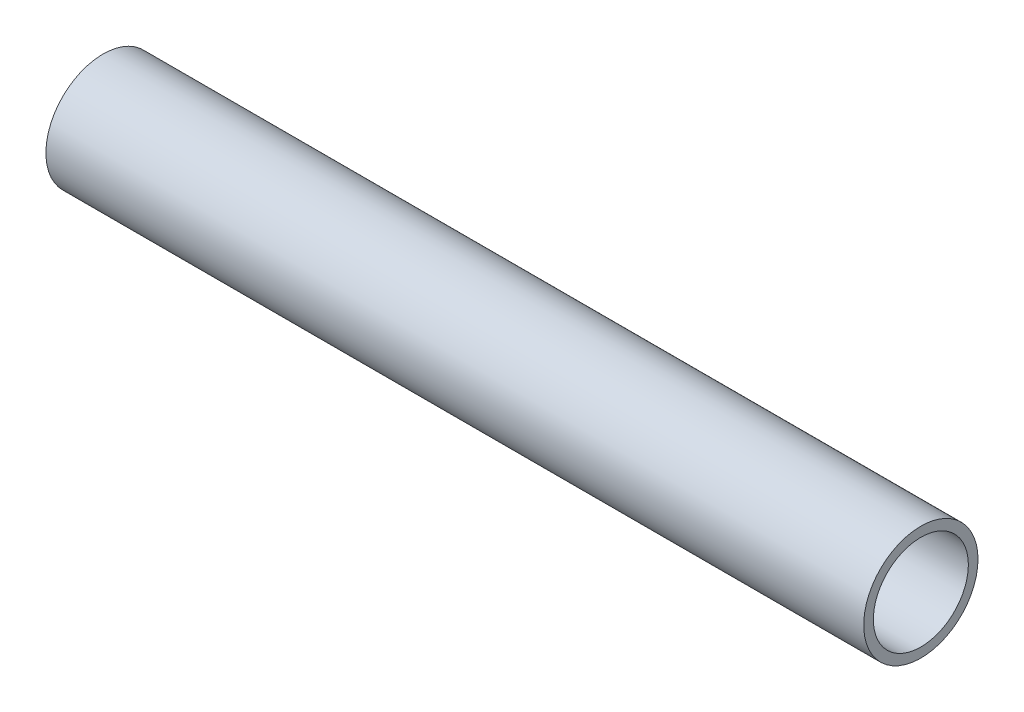
ISO-10303-21;
HEADER;
FILE_DESCRIPTION(('STEP AP214'),'2;1');
FILE_NAME('part.step','',(''),(''),'','','');
FILE_SCHEMA(('AUTOMOTIVE_DESIGN { 1 0 10303 214 1 1 1 1 }'));
ENDSEC;
DATA;
#1=APPLICATION_CONTEXT('core data for automotive mechanical design processes');
#2=APPLICATION_PROTOCOL_DEFINITION('international standard','automotive_design',2000,#1);
#3=PRODUCT_CONTEXT('',#1,'mechanical');
#4=PRODUCT('Part','Part','',(#3));
#5=PRODUCT_RELATED_PRODUCT_CATEGORY('part','',(#4));
#6=PRODUCT_DEFINITION_FORMATION('','',#4);
#7=PRODUCT_DEFINITION_CONTEXT('part definition',#1,'design');
#8=PRODUCT_DEFINITION('design','',#6,#7);
#9=PRODUCT_DEFINITION_SHAPE('','',#8);
#10=(LENGTH_UNIT() NAMED_UNIT(*) SI_UNIT(.MILLI.,.METRE.));
#11=(NAMED_UNIT(*) PLANE_ANGLE_UNIT() SI_UNIT($,.RADIAN.));
#12=(NAMED_UNIT(*) SI_UNIT($,.STERADIAN.) SOLID_ANGLE_UNIT());
#13=UNCERTAINTY_MEASURE_WITH_UNIT(LENGTH_MEASURE(1.E-05),#10,'distance_accuracy_value','');
#14=(GEOMETRIC_REPRESENTATION_CONTEXT(3) GLOBAL_UNCERTAINTY_ASSIGNED_CONTEXT((#13)) GLOBAL_UNIT_ASSIGNED_CONTEXT((#10,
#11,#12)) REPRESENTATION_CONTEXT('',''));
#15=CARTESIAN_POINT('',(0.,0.,0.));
#16=DIRECTION('',(0.,0.,1.));
#17=DIRECTION('',(1.,0.,0.));
#18=AXIS2_PLACEMENT_3D('',#15,#16,#17);
#19=CARTESIAN_POINT('',(-174.625,0.,0.));
#20=DIRECTION('',(1.,0.,0.));
#21=DIRECTION('',(0.,0.,-1.));
#22=AXIS2_PLACEMENT_3D('',#19,#20,#21);
#23=CYLINDRICAL_SURFACE('',#22,21.082);
#24=CARTESIAN_POINT('',(-95.25,0.,-21.082));
#25=CARTESIAN_POINT('',(-95.2500073037573,-0.177265588906064,-21.0819971511082));
#26=CARTESIAN_POINT('',(-95.2648956722781,-0.354633825443564,-21.0797407978607));
#27=CARTESIAN_POINT('',(-95.3240403602155,-0.704412011201185,-21.0709569196678));
#28=CARTESIAN_POINT('',(-95.3683252199961,-0.876816971803983,-21.064425243998));
#29=CARTESIAN_POINT('',(-95.4849091388346,-1.21155604974819,-21.0478246855302));
#30=CARTESIAN_POINT('',(-95.5571869641717,-1.37389769247853,-21.0377584843423));
#31=CARTESIAN_POINT('',(-95.7276530975323,-1.68412370373539,-21.0152009969064));
#32=CARTESIAN_POINT('',(-95.8258378289602,-1.83201006403648,-21.0027100454717));
#33=CARTESIAN_POINT('',(-96.0461542058056,-2.1103164343508,-20.9765819826565));
#34=CARTESIAN_POINT('',(-96.1684495601003,-2.24060616148058,-20.9629374218632));
#35=CARTESIAN_POINT('',(-96.4331633864275,-2.47889671955908,-20.9360982303561));
#36=CARTESIAN_POINT('',(-96.5755830188655,-2.58689626432783,-20.9229036256421));
#37=CARTESIAN_POINT('',(-96.8773786544134,-2.77804840978028,-20.8983859912104));
#38=CARTESIAN_POINT('',(-97.0368354067939,-2.86107486347092,-20.8870725883659));
#39=CARTESIAN_POINT('',(-97.3676295731584,-2.99911783525677,-20.8677000439257));
#40=CARTESIAN_POINT('',(-97.5389663337644,-3.05413589237424,-20.8596407235276));
#41=CARTESIAN_POINT('',(-97.8872863628436,-3.13419550245968,-20.8477621012251));
#42=CARTESIAN_POINT('',(-98.0642172558634,-3.15946016290709,-20.8439112577396));
#43=CARTESIAN_POINT('',(-98.419845943067,-3.17998699422211,-20.8407898425614));
#44=CARTESIAN_POINT('',(-98.5985436343971,-3.17525090142445,-20.8415190057945));
#45=CARTESIAN_POINT('',(-98.9510567099515,-3.13609297404926,-20.8474463775802));
#46=CARTESIAN_POINT('',(-99.1249004248299,-3.101919701057,-20.852607165254));
#47=CARTESIAN_POINT('',(-99.4643579756068,-3.00524659900985,-20.8667578327125));
#48=CARTESIAN_POINT('',(-99.6299715768266,-2.94274596272441,-20.8757478216156));
#49=CARTESIAN_POINT('',(-99.9490235812398,-2.7909340011809,-20.8965852461813));
#50=CARTESIAN_POINT('',(-100.102411162019,-2.70151746318004,-20.9084438587404));
#51=CARTESIAN_POINT('',(-100.392099144084,-2.498486828096,-20.9336742925736));
#52=CARTESIAN_POINT('',(-100.528398414064,-2.38487113028628,-20.9470462139227));
#53=CARTESIAN_POINT('',(-100.781481243325,-2.1353032656861,-20.9739618878806));
#54=CARTESIAN_POINT('',(-100.898054144489,-1.9991374095518,-20.9875060134767));
#55=CARTESIAN_POINT('',(-101.106725455512,-1.70906259522473,-21.0131148002247));
#56=CARTESIAN_POINT('',(-101.198823756631,-1.55515355820368,-21.0251794548033));
#57=CARTESIAN_POINT('',(-101.355942659601,-1.23377816277264,-21.0464826923882));
#58=CARTESIAN_POINT('',(-101.420946926471,-1.06630369822491,-21.0557195696406));
#59=CARTESIAN_POINT('',(-101.521848958346,-0.722645240857131,-21.070312259879));
#60=CARTESIAN_POINT('',(-101.557748707077,-0.546461842495156,-21.0756683373726));
#61=CARTESIAN_POINT('',(-101.599142333219,-0.192204765370484,-21.0818608911754));
#62=CARTESIAN_POINT('',(-101.604925808796,-0.0141656498471117,-21.0827404122035));
#63=CARTESIAN_POINT('',(-101.586691518388,0.340339952440575,-21.0799979514801));
#64=CARTESIAN_POINT('',(-101.562674682621,0.516806488119838,-21.0763761102388));
#65=CARTESIAN_POINT('',(-101.485762333879,0.862279899383912,-21.0650645063623));
#66=CARTESIAN_POINT('',(-101.433007989693,1.03131891039134,-21.0573946347692));
#67=CARTESIAN_POINT('',(-101.300267051749,1.35815274399449,-21.0388441665934));
#68=CARTESIAN_POINT('',(-101.220279170212,1.51594703443953,-21.0279634181826));
#69=CARTESIAN_POINT('',(-101.034662860785,1.8170851157619,-21.0040933283749));
#70=CARTESIAN_POINT('',(-100.928850826916,1.9603145348408,-20.9910891189132));
#71=CARTESIAN_POINT('',(-100.694845351182,2.22708618632573,-20.9644655933992));
#72=CARTESIAN_POINT('',(-100.566650597521,2.35062726403486,-20.9508462413297));
#73=CARTESIAN_POINT('',(-100.290229093112,2.57556977848285,-20.9243908347895));
#74=CARTESIAN_POINT('',(-100.141843493739,2.67677703259561,-20.9115622997957));
#75=CARTESIAN_POINT('',(-99.8300080053974,2.85282903090451,-20.888274456038));
#76=CARTESIAN_POINT('',(-99.6665585261644,2.92767449187153,-20.8778150828597));
#77=CARTESIAN_POINT('',(-99.3298127983176,3.04857772519442,-20.8605043047131));
#78=CARTESIAN_POINT('',(-99.156553855138,3.09473749350593,-20.8536401303661));
#79=CARTESIAN_POINT('',(-98.8046316089195,3.15728352894343,-20.8442630448294));
#80=CARTESIAN_POINT('',(-98.6259686832474,3.17367187018762,-20.8417498305174));
#81=CARTESIAN_POINT('',(-98.2702456638402,3.17616021106898,-20.8413705974415));
#82=CARTESIAN_POINT('',(-98.0931876803551,3.16256554437416,-20.8434577306442));
#83=CARTESIAN_POINT('',(-97.7439067922048,3.10612829026899,-20.8519421795031));
#84=CARTESIAN_POINT('',(-97.5716838795403,3.0632857512491,-20.8583394880282));
#85=CARTESIAN_POINT('',(-97.2370476835853,2.94967717748468,-20.874707044174));
#86=CARTESIAN_POINT('',(-97.0746269537971,2.87893265513937,-20.8846745386426));
#87=CARTESIAN_POINT('',(-96.7639105714977,2.71155871536682,-20.9070627102117));
#88=CARTESIAN_POINT('',(-96.6156154052644,2.61492840724794,-20.9194834717215));
#89=CARTESIAN_POINT('',(-96.3358087193127,2.39741725845485,-20.9455292166376));
#90=CARTESIAN_POINT('',(-96.2044739082908,2.27631033164997,-20.9591647100844));
#91=CARTESIAN_POINT('',(-95.9638828183518,2.01376149306829,-20.9860159394496));
#92=CARTESIAN_POINT('',(-95.8546316769312,1.87231486257537,-20.9992315770924));
#93=CARTESIAN_POINT('',(-95.6607669697578,1.57217776718591,-21.0238378848768));
#94=CARTESIAN_POINT('',(-95.5762935254673,1.41339594518084,-21.0352180180234));
#95=CARTESIAN_POINT('',(-95.4353412780308,1.08380087043067,-21.0547677779054));
#96=CARTESIAN_POINT('',(-95.3788335193363,0.913000272113382,-21.0629407235248));
#97=CARTESIAN_POINT('',(-95.3082168635909,0.61786433248082,-21.0732924950954));
#98=CARTESIAN_POINT('',(-95.2864189599853,0.495349503289427,-21.0765410154751));
#99=CARTESIAN_POINT('',(-95.2573080583054,0.248573261637359,-21.0808957533839));
#100=CARTESIAN_POINT('',(-95.2499948780599,0.124311871162614,-21.0820019978558));
#101=CARTESIAN_POINT('',(-95.25,0.,-21.082));
#102=B_SPLINE_CURVE_WITH_KNOTS('',3,(#24,#25,#26,#27,#28,#29,#30,#31,#32,#33,#34,#35,#36,#37,
#38,#39,#40,#41,#42,#43,#44,#45,#46,#47,#48,#49,#50,#51,#52,#53,#54,#55,#56,#57,#58,#59,#60,#61,
#62,#63,#64,#65,#66,#67,#68,#69,#70,#71,#72,#73,#74,#75,#76,#77,#78,#79,#80,#81,#82,#83,#84,#85,
#86,#87,#88,#89,#90,#91,#92,#93,#94,#95,#96,#97,#98,#99,#100,#101),.UNSPECIFIED.,.T.,.F.,(4,2,2,
2,2,2,2,2,2,2,2,2,2,2,2,2,2,2,2,2,2,2,2,2,2,2,2,2,2,2,2,2,2,2,2,2,2,2,4),(0.,0.531342512429038,
1.06320164882558,1.5946581376531,2.12604129424767,2.66116512439551,3.19631982343617,
3.73413403476704,4.27191869076775,4.80564452954641,5.33933947849273,5.86857170164552,
6.39781900700991,6.92916258470441,7.46054132064733,7.99727852314497,8.53401811031673,
9.07108083107699,9.6081069432693,10.1399593459211,10.6717951472021,11.2010416383702,
11.730313159249,12.2634633412738,12.7966447804,13.3342937698578,13.8719281396386,
14.4076397711918,14.9433140793118,15.4735585288678,16.0038021011393,16.5336376528597,
17.0634914377811,17.5984835709691,18.1336000206727,18.6716867332597,19.2092151415009,
19.5818368843675,19.9544539408189),.UNSPECIFIED.);
#103=CARTESIAN_POINT('',(-95.25,0.,-21.082));
#104=VERTEX_POINT('',#103);
#105=EDGE_CURVE('E80',#104,#104,#102,.T.);
#106=ORIENTED_EDGE('',*,*,#105,.F.);
#107=EDGE_LOOP('',(#106));
#108=FACE_BOUND('',#107,.T.);
#109=CARTESIAN_POINT('',(-146.05,0.,-21.082));
#110=CARTESIAN_POINT('',(-146.050007303757,-0.177265588906064,-21.0819971511082));
#111=CARTESIAN_POINT('',(-146.064895672278,-0.354633825443566,-21.0797407978607));
#112=CARTESIAN_POINT('',(-146.124040360215,-0.704412011201187,-21.0709569196678));
#113=CARTESIAN_POINT('',(-146.168325219996,-0.876816971803985,-21.064425243998));
#114=CARTESIAN_POINT('',(-146.284909138835,-1.21155604974819,-21.0478246855302));
#115=CARTESIAN_POINT('',(-146.357186964172,-1.37389769247854,-21.0377584843423));
#116=CARTESIAN_POINT('',(-146.527653097532,-1.6841237037354,-21.0152009969064));
#117=CARTESIAN_POINT('',(-146.62583782896,-1.8320100640365,-21.0027100454717));
#118=CARTESIAN_POINT('',(-146.846154205806,-2.11031643435081,-20.9765819826565));
#119=CARTESIAN_POINT('',(-146.9684495601,-2.24060616148059,-20.9629374218632));
#120=CARTESIAN_POINT('',(-147.233163386427,-2.47889671955909,-20.9360982303561));
#121=CARTESIAN_POINT('',(-147.375583018865,-2.58689626432784,-20.9229036256421));
#122=CARTESIAN_POINT('',(-147.677378654413,-2.77804840978029,-20.8983859912104));
#123=CARTESIAN_POINT('',(-147.836835406794,-2.86107486347093,-20.8870725883659));
#124=CARTESIAN_POINT('',(-148.167629573158,-2.99911783525678,-20.8677000439257));
#125=CARTESIAN_POINT('',(-148.338966333764,-3.05413589237425,-20.8596407235276));
#126=CARTESIAN_POINT('',(-148.687286362844,-3.13419550245969,-20.8477621012251));
#127=CARTESIAN_POINT('',(-148.864217255863,-3.15946016290709,-20.8439112577396));
#128=CARTESIAN_POINT('',(-149.219845943067,-3.17998699422211,-20.8407898425614));
#129=CARTESIAN_POINT('',(-149.398543634397,-3.17525090142445,-20.8415190057945));
#130=CARTESIAN_POINT('',(-149.751056709951,-3.13609297404926,-20.8474463775802));
#131=CARTESIAN_POINT('',(-149.92490042483,-3.101919701057,-20.852607165254));
#132=CARTESIAN_POINT('',(-150.264357975607,-3.00524659900985,-20.8667578327125));
#133=CARTESIAN_POINT('',(-150.429971576827,-2.9427459627244,-20.8757478216156));
#134=CARTESIAN_POINT('',(-150.74902358124,-2.79093400118089,-20.8965852461813));
#135=CARTESIAN_POINT('',(-150.902411162019,-2.70151746318001,-20.9084438587404));
#136=CARTESIAN_POINT('',(-151.192099144084,-2.49848682809597,-20.9336742925736));
#137=CARTESIAN_POINT('',(-151.328398414064,-2.38487113028625,-20.9470462139227));
#138=CARTESIAN_POINT('',(-151.581481243325,-2.13530326568607,-20.9739618878807));
#139=CARTESIAN_POINT('',(-151.698054144489,-1.99913740955177,-20.9875060134767));
#140=CARTESIAN_POINT('',(-151.906725455512,-1.70906259522471,-21.0131148002247));
#141=CARTESIAN_POINT('',(-151.998823756631,-1.55515355820366,-21.0251794548033));
#142=CARTESIAN_POINT('',(-152.155942659601,-1.23377816277263,-21.0464826923882));
#143=CARTESIAN_POINT('',(-152.220946926471,-1.0663036982249,-21.0557195696406));
#144=CARTESIAN_POINT('',(-152.321848958346,-0.722645240857127,-21.070312259879));
#145=CARTESIAN_POINT('',(-152.357748707077,-0.546461842495151,-21.0756683373726));
#146=CARTESIAN_POINT('',(-152.399142333219,-0.192204765370476,-21.0818608911754));
#147=CARTESIAN_POINT('',(-152.404925808796,-0.014165649847103,-21.0827404122035));
#148=CARTESIAN_POINT('',(-152.386691518388,0.340339952440583,-21.0799979514801));
#149=CARTESIAN_POINT('',(-152.362674682621,0.516806488119846,-21.0763761102388));
#150=CARTESIAN_POINT('',(-152.285762333879,0.86227989938392,-21.0650645063623));
#151=CARTESIAN_POINT('',(-152.233007989693,1.03131891039135,-21.0573946347692));
#152=CARTESIAN_POINT('',(-152.100267051749,1.3581527439945,-21.0388441665934));
#153=CARTESIAN_POINT('',(-152.020279170212,1.51594703443955,-21.0279634181826));
#154=CARTESIAN_POINT('',(-151.834662860785,1.8170851157619,-21.0040933283749));
#155=CARTESIAN_POINT('',(-151.728850826916,1.96031453484078,-20.9910891189132));
#156=CARTESIAN_POINT('',(-151.494845351182,2.22708618632572,-20.9644655933992));
#157=CARTESIAN_POINT('',(-151.366650597521,2.35062726403487,-20.9508462413297));
#158=CARTESIAN_POINT('',(-151.090229093112,2.57556977848286,-20.9243908347895));
#159=CARTESIAN_POINT('',(-150.941843493739,2.67677703259561,-20.9115622997957));
#160=CARTESIAN_POINT('',(-150.630008005397,2.8528290309045,-20.888274456038));
#161=CARTESIAN_POINT('',(-150.466558526164,2.92767449187153,-20.8778150828597));
#162=CARTESIAN_POINT('',(-150.129812798318,3.04857772519442,-20.8605043047131));
#163=CARTESIAN_POINT('',(-149.956553855138,3.09473749350594,-20.8536401303661));
#164=CARTESIAN_POINT('',(-149.604631608919,3.15728352894343,-20.8442630448294));
#165=CARTESIAN_POINT('',(-149.425968683247,3.17367187018762,-20.8417498305174));
#166=CARTESIAN_POINT('',(-149.07024566384,3.17616021106899,-20.8413705974415));
#167=CARTESIAN_POINT('',(-148.893187680355,3.16256554437416,-20.8434577306442));
#168=CARTESIAN_POINT('',(-148.543906792205,3.10612829026899,-20.8519421795031));
#169=CARTESIAN_POINT('',(-148.37168387954,3.0632857512491,-20.8583394880282));
#170=CARTESIAN_POINT('',(-148.037047683585,2.94967717748468,-20.874707044174));
#171=CARTESIAN_POINT('',(-147.874626953797,2.87893265513936,-20.8846745386426));
#172=CARTESIAN_POINT('',(-147.563910571498,2.71155871536682,-20.9070627102117));
#173=CARTESIAN_POINT('',(-147.415615405264,2.61492840724794,-20.9194834717215));
#174=CARTESIAN_POINT('',(-147.135808719313,2.39741725845485,-20.9455292166376));
#175=CARTESIAN_POINT('',(-147.004473908291,2.27631033164997,-20.9591647100844));
#176=CARTESIAN_POINT('',(-146.763882818352,2.01376149306828,-20.9860159394496));
#177=CARTESIAN_POINT('',(-146.654631676931,1.87231486257536,-20.9992315770924));
#178=CARTESIAN_POINT('',(-146.460766969758,1.57217776718591,-21.0238378848768));
#179=CARTESIAN_POINT('',(-146.376293525467,1.41339594518084,-21.0352180180234));
#180=CARTESIAN_POINT('',(-146.235341278031,1.08380087043067,-21.0547677779054));
#181=CARTESIAN_POINT('',(-146.178833519336,0.913000272113373,-21.0629407235248));
#182=CARTESIAN_POINT('',(-146.108216863591,0.617864332480807,-21.0732924950954));
#183=CARTESIAN_POINT('',(-146.086418959985,0.495349503289417,-21.0765410154751));
#184=CARTESIAN_POINT('',(-146.057308058305,0.248573261637354,-21.0808957533839));
#185=CARTESIAN_POINT('',(-146.04999487806,0.124311871162612,-21.0820019978558));
#186=CARTESIAN_POINT('',(-146.05,0.,-21.082));
#187=B_SPLINE_CURVE_WITH_KNOTS('',3,(#109,#110,#111,#112,#113,#114,#115,#116,#117,#118,#119,
#120,#121,#122,#123,#124,#125,#126,#127,#128,#129,#130,#131,#132,#133,#134,#135,#136,#137,#138,
#139,#140,#141,#142,#143,#144,#145,#146,#147,#148,#149,#150,#151,#152,#153,#154,#155,#156,#157,
#158,#159,#160,#161,#162,#163,#164,#165,#166,#167,#168,#169,#170,#171,#172,#173,#174,#175,#176,
#177,#178,#179,#180,#181,#182,#183,#184,#185,#186),.UNSPECIFIED.,.T.,.F.,(4,2,2,2,2,2,2,2,2,2,2,
2,2,2,2,2,2,2,2,2,2,2,2,2,2,2,2,2,2,2,2,2,2,2,2,2,2,2,4),(0.,0.53134251242904,1.06320164882559,
1.59465813765311,2.12604129424768,2.66116512439553,3.19631982343618,3.73413403476707,
4.27191869076778,4.80564452954643,5.33933947849274,5.86857170164554,6.39781900700992,
6.92916258470446,7.46054132064736,7.99727852314501,8.53401811031675,9.071080831077,
9.60810694326931,10.1399593459211,10.6717951472021,11.2010416383702,11.730313159249,
12.2634633412738,12.7966447804,13.3342937698578,13.8719281396386,14.4076397711918,
14.9433140793118,15.4735585288678,16.0038021011393,16.5336376528597,17.0634914377811,
17.5984835709691,18.1336000206728,18.6716867332597,19.2092151415009,19.5818368843675,
19.9544539408189),.UNSPECIFIED.);
#188=CARTESIAN_POINT('',(-146.05,0.,-21.082));
#189=VERTEX_POINT('',#188);
#190=EDGE_CURVE('E62',#189,#189,#187,.T.);
#191=ORIENTED_EDGE('',*,*,#190,.F.);
#192=EDGE_LOOP('',(#191));
#193=FACE_BOUND('',#192,.T.);
#194=CARTESIAN_POINT('',(-174.625,0.,0.));
#195=DIRECTION('',(1.,0.,0.));
#196=DIRECTION('',(0.,0.,-1.));
#197=AXIS2_PLACEMENT_3D('',#194,#195,#196);
#198=CIRCLE('',#197,21.082);
#199=CARTESIAN_POINT('',(-174.625,0.,-21.082));
#200=VERTEX_POINT('',#199);
#201=EDGE_CURVE('E10',#200,#200,#198,.T.);
#202=ORIENTED_EDGE('',*,*,#201,.T.);
#203=EDGE_LOOP('',(#202));
#204=FACE_BOUND('',#203,.T.);
#205=CARTESIAN_POINT('',(127.,0.,0.));
#206=DIRECTION('',(1.,0.,0.));
#207=DIRECTION('',(0.,0.,-1.));
#208=AXIS2_PLACEMENT_3D('',#205,#206,#207);
#209=CIRCLE('',#208,21.082);
#210=CARTESIAN_POINT('',(127.,0.,-21.082));
#211=VERTEX_POINT('',#210);
#212=EDGE_CURVE('E53',#211,#211,#209,.T.);
#213=ORIENTED_EDGE('',*,*,#212,.F.);
#214=EDGE_LOOP('',(#213));
#215=FACE_BOUND('',#214,.T.);
#216=ADVANCED_FACE('F35',(#108,#193,#204,#215),#23,.T.);
#217=CARTESIAN_POINT('',(-174.625,0.,0.));
#218=DIRECTION('',(1.,0.,0.));
#219=DIRECTION('',(0.,0.,-1.));
#220=AXIS2_PLACEMENT_3D('',#217,#218,#219);
#221=PLANE('',#220);
#222=CARTESIAN_POINT('',(-174.625,0.,0.));
#223=DIRECTION('',(1.,0.,0.));
#224=DIRECTION('',(0.,0.,-1.));
#225=AXIS2_PLACEMENT_3D('',#222,#223,#224);
#226=CIRCLE('',#225,17.526);
#227=CARTESIAN_POINT('',(-174.625,0.,-17.526));
#228=VERTEX_POINT('',#227);
#229=EDGE_CURVE('E48',#228,#228,#226,.T.);
#230=ORIENTED_EDGE('',*,*,#229,.T.);
#231=EDGE_LOOP('',(#230));
#232=FACE_BOUND('',#231,.T.);
#233=ORIENTED_EDGE('',*,*,#201,.F.);
#234=EDGE_LOOP('',(#233));
#235=FACE_BOUND('',#234,.T.);
#236=ADVANCED_FACE('F94',(#232,#235),#221,.F.);
#237=CARTESIAN_POINT('',(-174.625,0.,0.));
#238=DIRECTION('',(1.,0.,0.));
#239=DIRECTION('',(0.,0.,-1.));
#240=AXIS2_PLACEMENT_3D('',#237,#238,#239);
#241=CYLINDRICAL_SURFACE('',#240,17.526);
#242=CARTESIAN_POINT('',(-101.6,0.,-17.526));
#243=CARTESIAN_POINT('',(-101.599993132515,0.17679082350801,-17.5259968412274));
#244=CARTESIAN_POINT('',(-101.585183965731,0.353672270747988,-17.5232972774411));
#245=CARTESIAN_POINT('',(-101.526372438004,0.702458155041369,-17.5127883009458));
#246=CARTESIAN_POINT('',(-101.482344740396,0.874358137310072,-17.5049744534986));
#247=CARTESIAN_POINT('',(-101.366482418544,1.20808580036967,-17.485111731742));
#248=CARTESIAN_POINT('',(-101.29467216344,1.36992216434489,-17.4730665697294));
#249=CARTESIAN_POINT('',(-101.125350679922,1.67923272236702,-17.4460593997375));
#250=CARTESIAN_POINT('',(-101.027841801324,1.82670822784651,-17.4310976584752));
#251=CARTESIAN_POINT('',(-100.808729501993,2.10478127681952,-17.3997234174553));
#252=CARTESIAN_POINT('',(-100.686893953305,2.23519445696564,-17.3832978577657));
#253=CARTESIAN_POINT('',(-100.423086238519,2.47384671567764,-17.3509451203049));
#254=CARTESIAN_POINT('',(-100.281112684689,2.58208426483874,-17.3350179769725));
#255=CARTESIAN_POINT('',(-99.97976755925,2.77407084888639,-17.3053386524232));
#256=CARTESIAN_POINT('',(-99.82027574471,2.8576339824516,-17.2916033234658));
#257=CARTESIAN_POINT('',(-99.4892275026837,2.99671002667021,-17.2680459841376));
#258=CARTESIAN_POINT('',(-99.3176720447767,3.05222518866685,-17.2582236596927));
#259=CARTESIAN_POINT('',(-98.9693334205962,3.13304110203761,-17.2437354838221));
#260=CARTESIAN_POINT('',(-98.7926269370351,3.15866238598856,-17.2390149702052));
#261=CARTESIAN_POINT('',(-98.4373650062532,3.17995782064228,-17.235099927382));
#262=CARTESIAN_POINT('',(-98.2588097149559,3.1756344765814,-17.2359049358977));
#263=CARTESIAN_POINT('',(-97.9072300510038,3.13742365897766,-17.2429001682717));
#264=CARTESIAN_POINT('',(-97.7341647086679,3.10389926153133,-17.2490242538492));
#265=CARTESIAN_POINT('',(-97.3961562140921,3.00880912932249,-17.2658638407267));
#266=CARTESIAN_POINT('',(-97.231213386391,2.94724227511612,-17.2765795253205));
#267=CARTESIAN_POINT('',(-96.9130619363625,2.79745571266688,-17.3014647929721));
#268=CARTESIAN_POINT('',(-96.7599245079335,2.7090880872545,-17.3156534578234));
#269=CARTESIAN_POINT('',(-96.470514150003,2.50831315208051,-17.3458731721502));
#270=CARTESIAN_POINT('',(-96.3342428236547,2.39590355985285,-17.3619043964854));
#271=CARTESIAN_POINT('',(-96.0803338962992,2.14827149301383,-17.3942918762038));
#272=CARTESIAN_POINT('',(-95.962999429291,2.01273815664841,-17.4106494468318));
#273=CARTESIAN_POINT('',(-95.7526886211131,1.72374960651158,-17.4416297211863));
#274=CARTESIAN_POINT('',(-95.6597124943575,1.57029423499867,-17.4562524096409));
#275=CARTESIAN_POINT('',(-95.500718396598,1.24951132270804,-17.4821419521182));
#276=CARTESIAN_POINT('',(-95.4347304486683,1.08216858038397,-17.4934050650234));
#277=CARTESIAN_POINT('',(-95.3318843483637,0.738524824278316,-17.5112771866033));
#278=CARTESIAN_POINT('',(-95.2950233103667,0.562224699752744,-17.5178866563105));
#279=CARTESIAN_POINT('',(-95.2518958271967,0.208280155645573,-17.5256438790602));
#280=CARTESIAN_POINT('',(-95.245213792981,0.0306879466818638,-17.5268658171028));
#281=CARTESIAN_POINT('',(-95.2615213711922,-0.323076767936696,-17.5239146703191));
#282=CARTESIAN_POINT('',(-95.2845096264779,-0.499249338156001,-17.5197418322538));
#283=CARTESIAN_POINT('',(-95.3591596423848,-0.843866600411555,-17.5065161011469));
#284=CARTESIAN_POINT('',(-95.4106125479722,-1.01235801735561,-17.4974987676082));
#285=CARTESIAN_POINT('',(-95.5405063595171,-1.33832313012139,-17.4755909179164));
#286=CARTESIAN_POINT('',(-95.6189490011885,-1.49579611656221,-17.4627001526692));
#287=CARTESIAN_POINT('',(-95.8015255027009,-1.7970379428255,-17.4342904171948));
#288=CARTESIAN_POINT('',(-95.9059150975122,-1.94064931955918,-17.4187457992515));
#289=CARTESIAN_POINT('',(-96.1370744185283,-2.20846506883692,-17.3868220571775));
#290=CARTESIAN_POINT('',(-96.2638460863583,-2.33266775593063,-17.3704428607355));
#291=CARTESIAN_POINT('',(-96.5380470534088,-2.55970748627499,-17.3384518393717));
#292=CARTESIAN_POINT('',(-96.6857120955064,-2.66226178053651,-17.3228519867864));
#293=CARTESIAN_POINT('',(-96.9964178334415,-2.84110984177048,-17.2944212278246));
#294=CARTESIAN_POINT('',(-97.1594579820262,-2.91740454296296,-17.2815902229488));
#295=CARTESIAN_POINT('',(-97.4955450343434,-3.04115979533501,-17.2602426012819));
#296=CARTESIAN_POINT('',(-97.6685416025097,-3.08875345587471,-17.2517060985603));
#297=CARTESIAN_POINT('',(-98.0202437321866,-3.15416897697809,-17.2398671271274));
#298=CARTESIAN_POINT('',(-98.1989486950753,-3.17199394891527,-17.2365641114227));
#299=CARTESIAN_POINT('',(-98.5541655418571,-3.17726742876193,-17.2355925385196));
#300=CARTESIAN_POINT('',(-98.7306707384355,-3.16516161695717,-17.2378413124165));
#301=CARTESIAN_POINT('',(-99.0790866320758,-3.11188910689162,-17.2475373034534));
#302=CARTESIAN_POINT('',(-99.2509973523558,-3.07072255551699,-17.2549844943182));
#303=CARTESIAN_POINT('',(-99.5851258972035,-2.96067981082377,-17.2742044563146));
#304=CARTESIAN_POINT('',(-99.7473590229442,-2.89184876708741,-17.2859701767276));
#305=CARTESIAN_POINT('',(-100.058046204287,-2.72847862049299,-17.3125070165183));
#306=CARTESIAN_POINT('',(-100.20649937582,-2.633937869728,-17.3272783285292));
#307=CARTESIAN_POINT('',(-100.487651300551,-2.42026944589855,-17.3584203635157));
#308=CARTESIAN_POINT('',(-100.620100559389,-2.30081626698696,-17.37481057328));
#309=CARTESIAN_POINT('',(-100.86322420719,-2.04139533634304,-17.4071948659678));
#310=CARTESIAN_POINT('',(-100.973893583025,-1.90142287454245,-17.4231888569539));
#311=CARTESIAN_POINT('',(-101.171171023297,-1.60354404533997,-17.4531342301883));
#312=CARTESIAN_POINT('',(-101.257571193469,-1.44549813095465,-17.4670675069251));
#313=CARTESIAN_POINT('',(-101.402456942508,-1.11693687333548,-17.4911451342375));
#314=CARTESIAN_POINT('',(-101.460969245347,-0.946433648982045,-17.5012931100993));
#315=CARTESIAN_POINT('',(-101.536276479759,-0.646146664812306,-17.5145413811557));
#316=CARTESIAN_POINT('',(-101.560132786512,-0.518138865968811,-17.5188145120769));
#317=CARTESIAN_POINT('',(-101.591996893811,-0.26010370060993,-17.5245449517082));
#318=CARTESIAN_POINT('',(-101.600005052851,-0.130076379844328,-17.5260023241122));
#319=CARTESIAN_POINT('',(-101.6,0.,-17.526));
#320=B_SPLINE_CURVE_WITH_KNOTS('',3,(#242,#243,#244,#245,#246,#247,#248,#249,#250,#251,#252,
#253,#254,#255,#256,#257,#258,#259,#260,#261,#262,#263,#264,#265,#266,#267,#268,#269,#270,#271,
#272,#273,#274,#275,#276,#277,#278,#279,#280,#281,#282,#283,#284,#285,#286,#287,#288,#289,#290,
#291,#292,#293,#294,#295,#296,#297,#298,#299,#300,#301,#302,#303,#304,#305,#306,#307,#308,#309,
#310,#311,#312,#313,#314,#315,#316,#317,#318,#319),.UNSPECIFIED.,.T.,.F.,(4,2,2,2,2,2,2,2,2,2,2,
2,2,2,2,2,2,2,2,2,2,2,2,2,2,2,2,2,2,2,2,2,2,2,2,2,2,2,4),(0.,0.52989684739867,1.06025379298761,
1.59014659312776,2.11999095802632,2.65515610450925,3.19035814774705,3.7294952286848,
4.26858902750702,4.80184775131232,5.33506186200683,5.86173930617047,6.38843777693352,
6.91809776769747,7.4478080649945,7.985299753981,8.52279617407827,9.06088891772033,
9.59892834547637,10.1295354893394,10.6601183636945,11.1868588327276,11.713633182854,
12.2458209999474,12.778055006572,13.3168607871052,13.8556473969222,14.3919156166157,
14.9281277829441,15.4564037756751,15.9846770982784,16.5120917356115,17.0395401864443,
17.5743685624972,18.1093198977251,18.6487229234539,19.1876080135939,19.5774960261897,
19.9673752191978),.UNSPECIFIED.);
#321=CARTESIAN_POINT('',(-101.6,0.,-17.526));
#322=VERTEX_POINT('',#321);
#323=EDGE_CURVE('E39',#322,#322,#320,.T.);
#324=ORIENTED_EDGE('',*,*,#323,.T.);
#325=EDGE_LOOP('',(#324));
#326=FACE_BOUND('',#325,.T.);
#327=CARTESIAN_POINT('',(-152.4,0.,-17.526));
#328=CARTESIAN_POINT('',(-152.399993132515,0.176790823508009,-17.5259968412274));
#329=CARTESIAN_POINT('',(-152.385183965731,0.353672270747985,-17.5232972774411));
#330=CARTESIAN_POINT('',(-152.326372438004,0.702458155041367,-17.5127883009458));
#331=CARTESIAN_POINT('',(-152.282344740396,0.874358137310074,-17.5049744534986));
#332=CARTESIAN_POINT('',(-152.166482418544,1.20808580036968,-17.485111731742));
#333=CARTESIAN_POINT('',(-152.09467216344,1.3699221643449,-17.4730665697294));
#334=CARTESIAN_POINT('',(-151.925350679922,1.67923272236704,-17.4460593997375));
#335=CARTESIAN_POINT('',(-151.827841801324,1.82670822784652,-17.4310976584752));
#336=CARTESIAN_POINT('',(-151.608729501993,2.10478127681953,-17.3997234174553));
#337=CARTESIAN_POINT('',(-151.486893953305,2.23519445696565,-17.3832978577657));
#338=CARTESIAN_POINT('',(-151.223086238519,2.47384671567765,-17.3509451203049));
#339=CARTESIAN_POINT('',(-151.081112684689,2.58208426483874,-17.3350179769725));
#340=CARTESIAN_POINT('',(-150.77976755925,2.77407084888639,-17.3053386524232));
#341=CARTESIAN_POINT('',(-150.62027574471,2.8576339824516,-17.2916033234658));
#342=CARTESIAN_POINT('',(-150.289227502684,2.99671002667021,-17.2680459841376));
#343=CARTESIAN_POINT('',(-150.117672044777,3.05222518866685,-17.2582236596927));
#344=CARTESIAN_POINT('',(-149.769333420596,3.13304110203761,-17.2437354838221));
#345=CARTESIAN_POINT('',(-149.592626937035,3.15866238598857,-17.2390149702052));
#346=CARTESIAN_POINT('',(-149.237365006253,3.17995782064228,-17.235099927382));
#347=CARTESIAN_POINT('',(-149.058809714956,3.1756344765814,-17.2359049358977));
#348=CARTESIAN_POINT('',(-148.707230051004,3.13742365897766,-17.2429001682717));
#349=CARTESIAN_POINT('',(-148.534164708668,3.10389926153133,-17.2490242538492));
#350=CARTESIAN_POINT('',(-148.196156214092,3.00880912932248,-17.2658638407267));
#351=CARTESIAN_POINT('',(-148.031213386391,2.94724227511611,-17.2765795253205));
#352=CARTESIAN_POINT('',(-147.713061936362,2.79745571266685,-17.3014647929721));
#353=CARTESIAN_POINT('',(-147.559924507933,2.70908808725447,-17.3156534578234));
#354=CARTESIAN_POINT('',(-147.270514150003,2.50831315208049,-17.3458731721502));
#355=CARTESIAN_POINT('',(-147.134242823655,2.39590355985283,-17.3619043964854));
#356=CARTESIAN_POINT('',(-146.880333896299,2.14827149301382,-17.3942918762038));
#357=CARTESIAN_POINT('',(-146.762999429291,2.01273815664841,-17.4106494468318));
#358=CARTESIAN_POINT('',(-146.552688621113,1.72374960651158,-17.4416297211863));
#359=CARTESIAN_POINT('',(-146.459712494357,1.57029423499867,-17.4562524096409));
#360=CARTESIAN_POINT('',(-146.300718396598,1.24951132270804,-17.4821419521182));
#361=CARTESIAN_POINT('',(-146.234730448668,1.08216858038396,-17.4934050650234));
#362=CARTESIAN_POINT('',(-146.131884348364,0.738524824278307,-17.5112771866033));
#363=CARTESIAN_POINT('',(-146.095023310367,0.562224699752732,-17.5178866563105));
#364=CARTESIAN_POINT('',(-146.051895827197,0.208280155645558,-17.5256438790602));
#365=CARTESIAN_POINT('',(-146.045213792981,0.0306879466818504,-17.5268658171028));
#366=CARTESIAN_POINT('',(-146.061521371192,-0.323076767936705,-17.5239146703191));
#367=CARTESIAN_POINT('',(-146.084509626478,-0.499249338156009,-17.5197418322538));
#368=CARTESIAN_POINT('',(-146.159159642385,-0.843866600411558,-17.5065161011469));
#369=CARTESIAN_POINT('',(-146.210612547972,-1.01235801735561,-17.4974987676082));
#370=CARTESIAN_POINT('',(-146.340506359517,-1.3383231301214,-17.4755909179164));
#371=CARTESIAN_POINT('',(-146.418949001188,-1.49579611656221,-17.4627001526692));
#372=CARTESIAN_POINT('',(-146.601525502701,-1.79703794282551,-17.4342904171948));
#373=CARTESIAN_POINT('',(-146.705915097512,-1.94064931955918,-17.4187457992515));
#374=CARTESIAN_POINT('',(-146.937074418528,-2.20846506883692,-17.3868220571775));
#375=CARTESIAN_POINT('',(-147.063846086358,-2.33266775593063,-17.3704428607355));
#376=CARTESIAN_POINT('',(-147.338047053409,-2.559707486275,-17.3384518393717));
#377=CARTESIAN_POINT('',(-147.485712095506,-2.66226178053653,-17.3228519867864));
#378=CARTESIAN_POINT('',(-147.796417833441,-2.84110984177049,-17.2944212278246));
#379=CARTESIAN_POINT('',(-147.959457982026,-2.91740454296297,-17.2815902229488));
#380=CARTESIAN_POINT('',(-148.295545034343,-3.04115979533501,-17.2602426012819));
#381=CARTESIAN_POINT('',(-148.46854160251,-3.08875345587471,-17.2517060985603));
#382=CARTESIAN_POINT('',(-148.820243732187,-3.1541689769781,-17.2398671271274));
#383=CARTESIAN_POINT('',(-148.998948695075,-3.17199394891528,-17.2365641114227));
#384=CARTESIAN_POINT('',(-149.354165541857,-3.17726742876193,-17.2355925385196));
#385=CARTESIAN_POINT('',(-149.530670738435,-3.16516161695717,-17.2378413124165));
#386=CARTESIAN_POINT('',(-149.879086632076,-3.11188910689162,-17.2475373034534));
#387=CARTESIAN_POINT('',(-150.050997352356,-3.07072255551698,-17.2549844943182));
#388=CARTESIAN_POINT('',(-150.385125897204,-2.96067981082376,-17.2742044563146));
#389=CARTESIAN_POINT('',(-150.547359022944,-2.8918487670874,-17.2859701767276));
#390=CARTESIAN_POINT('',(-150.858046204287,-2.72847862049297,-17.3125070165183));
#391=CARTESIAN_POINT('',(-151.00649937582,-2.63393786972798,-17.3272783285293));
#392=CARTESIAN_POINT('',(-151.287651300551,-2.42026944589853,-17.3584203635157));
#393=CARTESIAN_POINT('',(-151.420100559389,-2.30081626698695,-17.37481057328));
#394=CARTESIAN_POINT('',(-151.66322420719,-2.04139533634303,-17.4071948659678));
#395=CARTESIAN_POINT('',(-151.773893583025,-1.90142287454244,-17.4231888569539));
#396=CARTESIAN_POINT('',(-151.971171023297,-1.60354404533996,-17.4531342301883));
#397=CARTESIAN_POINT('',(-152.057571193469,-1.44549813095464,-17.4670675069251));
#398=CARTESIAN_POINT('',(-152.202456942508,-1.11693687333546,-17.4911451342375));
#399=CARTESIAN_POINT('',(-152.260969245347,-0.946433648982028,-17.5012931100993));
#400=CARTESIAN_POINT('',(-152.336276479759,-0.646146664812287,-17.5145413811557));
#401=CARTESIAN_POINT('',(-152.360132786512,-0.518138865968793,-17.5188145120769));
#402=CARTESIAN_POINT('',(-152.391996893811,-0.260103700609919,-17.5245449517082));
#403=CARTESIAN_POINT('',(-152.400005052851,-0.130076379844322,-17.5260023241122));
#404=CARTESIAN_POINT('',(-152.4,0.,-17.526));
#405=B_SPLINE_CURVE_WITH_KNOTS('',3,(#327,#328,#329,#330,#331,#332,#333,#334,#335,#336,#337,
#338,#339,#340,#341,#342,#343,#344,#345,#346,#347,#348,#349,#350,#351,#352,#353,#354,#355,#356,
#357,#358,#359,#360,#361,#362,#363,#364,#365,#366,#367,#368,#369,#370,#371,#372,#373,#374,#375,
#376,#377,#378,#379,#380,#381,#382,#383,#384,#385,#386,#387,#388,#389,#390,#391,#392,#393,#394,
#395,#396,#397,#398,#399,#400,#401,#402,#403,#404),.UNSPECIFIED.,.T.,.F.,(4,2,2,2,2,2,2,2,2,2,2,
2,2,2,2,2,2,2,2,2,2,2,2,2,2,2,2,2,2,2,2,2,2,2,2,2,2,2,4),(0.,0.52989684739867,1.06025379298762,
1.59014659312777,2.11999095802633,2.65515610450925,3.19035814774706,3.72949522868482,
4.26858902750703,4.80184775131235,5.33506186200683,5.86173930617047,6.3884377769336,
6.91809776769754,7.44780806499452,7.985299753981,8.52279617407827,9.06088891772035,
9.59892834547639,10.1295354893394,10.6601183636946,11.1868588327276,11.713633182854,
12.2458209999474,12.778055006572,13.3168607871052,13.8556473969223,14.3919156166158,
14.9281277829441,15.4564037756751,15.9846770982785,16.5120917356116,17.0395401864443,
17.5743685624972,18.1093198977252,18.648722923454,19.1876080135939,19.5774960261897,
19.9673752191978),.UNSPECIFIED.);
#406=CARTESIAN_POINT('',(-152.4,0.,-17.526));
#407=VERTEX_POINT('',#406);
#408=EDGE_CURVE('E56',#407,#407,#405,.T.);
#409=ORIENTED_EDGE('',*,*,#408,.T.);
#410=EDGE_LOOP('',(#409));
#411=FACE_BOUND('',#410,.T.);
#412=ORIENTED_EDGE('',*,*,#229,.F.);
#413=EDGE_LOOP('',(#412));
#414=FACE_BOUND('',#413,.T.);
#415=CARTESIAN_POINT('',(127.,0.,0.));
#416=DIRECTION('',(1.,0.,0.));
#417=DIRECTION('',(0.,0.,-1.));
#418=AXIS2_PLACEMENT_3D('',#415,#416,#417);
#419=CIRCLE('',#418,17.526);
#420=CARTESIAN_POINT('',(127.,0.,-17.526));
#421=VERTEX_POINT('',#420);
#422=EDGE_CURVE('E86',#421,#421,#419,.T.);
#423=ORIENTED_EDGE('',*,*,#422,.T.);
#424=EDGE_LOOP('',(#423));
#425=FACE_BOUND('',#424,.T.);
#426=ADVANCED_FACE('F63',(#326,#411,#414,#425),#241,.F.);
#427=CARTESIAN_POINT('',(127.,0.,0.));
#428=DIRECTION('',(1.,0.,0.));
#429=DIRECTION('',(0.,0.,-1.));
#430=AXIS2_PLACEMENT_3D('',#427,#428,#429);
#431=PLANE('',#430);
#432=ORIENTED_EDGE('',*,*,#212,.T.);
#433=EDGE_LOOP('',(#432));
#434=FACE_BOUND('',#433,.T.);
#435=ORIENTED_EDGE('',*,*,#422,.F.);
#436=EDGE_LOOP('',(#435));
#437=FACE_BOUND('',#436,.T.);
#438=ADVANCED_FACE('F70',(#434,#437),#431,.T.);
#439=CARTESIAN_POINT('',(-149.225,0.,-21.082));
#440=DIRECTION('',(0.,0.,1.));
#441=DIRECTION('',(1.,0.,0.));
#442=AXIS2_PLACEMENT_3D('',#439,#440,#441);
#443=CYLINDRICAL_SURFACE('',#442,3.17500000000009);
#444=ORIENTED_EDGE('',*,*,#190,.T.);
#445=EDGE_LOOP('',(#444));
#446=FACE_BOUND('',#445,.T.);
#447=ORIENTED_EDGE('',*,*,#408,.F.);
#448=EDGE_LOOP('',(#447));
#449=FACE_BOUND('',#448,.T.);
#450=ADVANCED_FACE('F66',(#446,#449),#443,.F.);
#451=CARTESIAN_POINT('',(-98.4250000000001,0.,-21.082));
#452=DIRECTION('',(0.,0.,1.));
#453=DIRECTION('',(1.,0.,0.));
#454=AXIS2_PLACEMENT_3D('',#451,#452,#453);
#455=CYLINDRICAL_SURFACE('',#454,3.17500000000008);
#456=ORIENTED_EDGE('',*,*,#105,.T.);
#457=EDGE_LOOP('',(#456));
#458=FACE_BOUND('',#457,.T.);
#459=ORIENTED_EDGE('',*,*,#323,.F.);
#460=EDGE_LOOP('',(#459));
#461=FACE_BOUND('',#460,.T.);
#462=ADVANCED_FACE('F69',(#458,#461),#455,.F.);
#463=CLOSED_SHELL('',(#216,#236,#426,#438,#450,#462));
#464=MANIFOLD_SOLID_BREP('B2',#463);
#465=ADVANCED_BREP_SHAPE_REPRESENTATION('',(#18,#464),#14);
#466=SHAPE_DEFINITION_REPRESENTATION(#9,#465);
ENDSEC;
END-ISO-10303-21;
